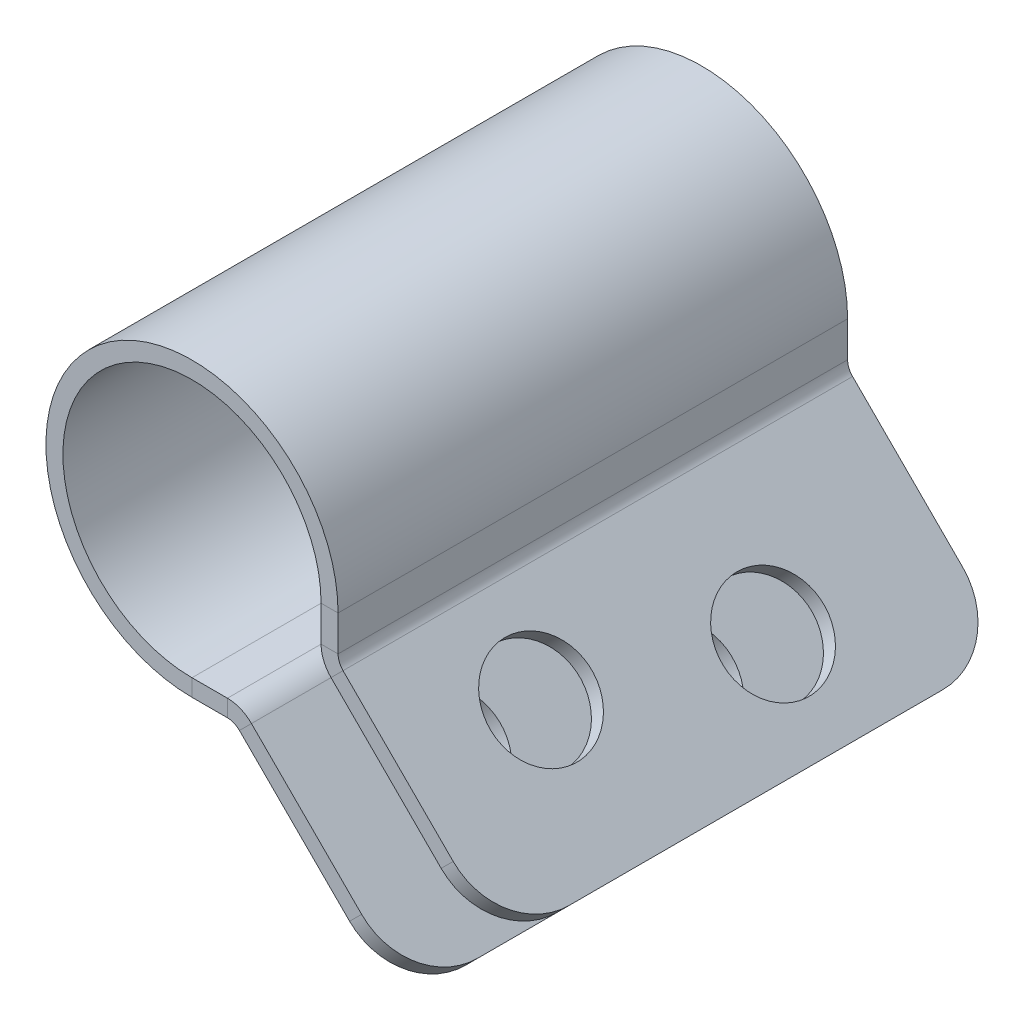
ISO-10303-21;
HEADER;
FILE_DESCRIPTION(('STEP AP214'),'2;1');
FILE_NAME('part.step','',(''),(''),'','','');
FILE_SCHEMA(('AUTOMOTIVE_DESIGN { 1 0 10303 214 1 1 1 1 }'));
ENDSEC;
DATA;
#1=APPLICATION_CONTEXT('core data for automotive mechanical design processes');
#2=APPLICATION_PROTOCOL_DEFINITION('international standard','automotive_design',2000,#1);
#3=PRODUCT_CONTEXT('',#1,'mechanical');
#4=PRODUCT('Part','Part','',(#3));
#5=PRODUCT_RELATED_PRODUCT_CATEGORY('part','',(#4));
#6=PRODUCT_DEFINITION_FORMATION('','',#4);
#7=PRODUCT_DEFINITION_CONTEXT('part definition',#1,'design');
#8=PRODUCT_DEFINITION('design','',#6,#7);
#9=PRODUCT_DEFINITION_SHAPE('','',#8);
#10=(LENGTH_UNIT() NAMED_UNIT(*) SI_UNIT(.MILLI.,.METRE.));
#11=(NAMED_UNIT(*) PLANE_ANGLE_UNIT() SI_UNIT($,.RADIAN.));
#12=(NAMED_UNIT(*) SI_UNIT($,.STERADIAN.) SOLID_ANGLE_UNIT());
#13=UNCERTAINTY_MEASURE_WITH_UNIT(LENGTH_MEASURE(1.E-05),#10,'distance_accuracy_value','');
#14=(GEOMETRIC_REPRESENTATION_CONTEXT(3) GLOBAL_UNCERTAINTY_ASSIGNED_CONTEXT((#13)) GLOBAL_UNIT_ASSIGNED_CONTEXT((#10,
#11,#12)) REPRESENTATION_CONTEXT('',''));
#15=CARTESIAN_POINT('',(0.,0.,0.));
#16=DIRECTION('',(0.,0.,1.));
#17=DIRECTION('',(1.,0.,0.));
#18=AXIS2_PLACEMENT_3D('',#15,#16,#17);
#19=CARTESIAN_POINT('',(3.84258768527902,2.34258768527897,-7.5));
#20=DIRECTION('',(0.,0.,-1.));
#21=DIRECTION('',(0.,-1.,0.));
#22=AXIS2_PLACEMENT_3D('',#19,#20,#21);
#23=PLANE('',#22);
#24=DIRECTION('',(0.,1.,0.));
#25=VECTOR('',#24,1.);
#26=CARTESIAN_POINT('',(4.34258768527924,23.342587685279,-7.5));
#27=LINE('',#26,#25);
#28=CARTESIAN_POINT('',(4.34258768527904,4.29999999999995,-7.5));
#29=VERTEX_POINT('',#28);
#30=CARTESIAN_POINT('',(4.34258768527903,3.25680124765206,-7.5));
#31=VERTEX_POINT('',#30);
#32=EDGE_CURVE('E344',#29,#31,#27,.F.);
#33=ORIENTED_EDGE('',*,*,#32,.T.);
#34=DIRECTION('',(-1.,0.,0.));
#35=VECTOR('',#34,1.);
#36=CARTESIAN_POINT('',(4.34258768527903,3.25680124765206,-7.5));
#37=LINE('',#36,#35);
#38=CARTESIAN_POINT('',(3.84258768527903,3.25680124765206,-7.5));
#39=VERTEX_POINT('',#38);
#40=EDGE_CURVE('E269',#31,#39,#37,.T.);
#41=ORIENTED_EDGE('',*,*,#40,.T.);
#42=DIRECTION('',(0.,-1.,0.));
#43=VECTOR('',#42,1.);
#44=CARTESIAN_POINT('',(3.84258768527902,2.34258768527897,-7.5));
#45=LINE('',#44,#43);
#46=CARTESIAN_POINT('',(3.84258768527904,4.29999999999996,-7.5));
#47=VERTEX_POINT('',#46);
#48=EDGE_CURVE('E381',#47,#39,#45,.T.);
#49=ORIENTED_EDGE('',*,*,#48,.F.);
#50=DIRECTION('',(1.,0.,0.));
#51=VECTOR('',#50,1.);
#52=CARTESIAN_POINT('',(3.84258768527904,4.29999999999996,-7.5));
#53=LINE('',#52,#51);
#54=EDGE_CURVE('E373',#47,#29,#53,.T.);
#55=ORIENTED_EDGE('',*,*,#54,.T.);
#56=EDGE_LOOP('',(#33,#41,#49,#55));
#57=FACE_BOUND('',#56,.T.);
#58=ADVANCED_FACE('F83',(#57),#23,.T.);
#59=CARTESIAN_POINT('',(3.84258768527924,23.342587685279,0.));
#60=DIRECTION('',(-1.,0.,0.));
#61=DIRECTION('',(0.,0.,1.));
#62=AXIS2_PLACEMENT_3D('',#59,#60,#61);
#63=PLANE('',#62);
#64=ORIENTED_EDGE('',*,*,#48,.T.);
#65=DIRECTION('',(0.,0.,-1.));
#66=VECTOR('',#65,1.);
#67=CARTESIAN_POINT('',(3.84258768527903,3.25680124765206,-7.5));
#68=LINE('',#67,#66);
#69=CARTESIAN_POINT('',(3.84258768527903,3.25680124765207,7.5));
#70=VERTEX_POINT('',#69);
#71=EDGE_CURVE('E230',#39,#70,#68,.F.);
#72=ORIENTED_EDGE('',*,*,#71,.T.);
#73=DIRECTION('',(0.,1.,0.));
#74=VECTOR('',#73,1.);
#75=CARTESIAN_POINT('',(3.84258768527902,2.34258768527898,7.5));
#76=LINE('',#75,#74);
#77=CARTESIAN_POINT('',(3.84258768527904,4.29999999999996,7.5));
#78=VERTEX_POINT('',#77);
#79=EDGE_CURVE('E368',#70,#78,#76,.T.);
#80=ORIENTED_EDGE('',*,*,#79,.T.);
#81=DIRECTION('',(0.,0.,-1.));
#82=VECTOR('',#81,1.);
#83=CARTESIAN_POINT('',(3.84258768527904,4.29999999999996,0.));
#84=LINE('',#83,#82);
#85=EDGE_CURVE('E364',#78,#47,#84,.T.);
#86=ORIENTED_EDGE('',*,*,#85,.T.);
#87=EDGE_LOOP('',(#64,#72,#80,#86));
#88=FACE_BOUND('',#87,.T.);
#89=ADVANCED_FACE('F478',(#88),#63,.T.);
#90=CARTESIAN_POINT('',(4.34258768527924,23.342587685279,0.));
#91=DIRECTION('',(-1.,0.,0.));
#92=DIRECTION('',(0.,0.,1.));
#93=AXIS2_PLACEMENT_3D('',#90,#91,#92);
#94=PLANE('',#93);
#95=DIRECTION('',(0.,0.,-1.));
#96=VECTOR('',#95,1.);
#97=CARTESIAN_POINT('',(4.34258768527903,3.25680124765206,-7.5));
#98=LINE('',#97,#96);
#99=CARTESIAN_POINT('',(4.34258768527903,3.25680124765207,7.5));
#100=VERTEX_POINT('',#99);
#101=EDGE_CURVE('E273',#31,#100,#98,.F.);
#102=ORIENTED_EDGE('',*,*,#101,.F.);
#103=ORIENTED_EDGE('',*,*,#32,.F.);
#104=DIRECTION('',(0.,0.,-1.));
#105=VECTOR('',#104,1.);
#106=CARTESIAN_POINT('',(4.34258768527904,4.29999999999995,0.));
#107=LINE('',#106,#105);
#108=CARTESIAN_POINT('',(4.34258768527904,4.29999999999995,7.5));
#109=VERTEX_POINT('',#108);
#110=EDGE_CURVE('E371',#109,#29,#107,.T.);
#111=ORIENTED_EDGE('',*,*,#110,.F.);
#112=DIRECTION('',(0.,1.,0.));
#113=VECTOR('',#112,1.);
#114=CARTESIAN_POINT('',(4.34258768527924,23.342587685279,7.5));
#115=LINE('',#114,#113);
#116=EDGE_CURVE('E379',#100,#109,#115,.T.);
#117=ORIENTED_EDGE('',*,*,#116,.F.);
#118=EDGE_LOOP('',(#102,#103,#111,#117));
#119=FACE_BOUND('',#118,.T.);
#120=ADVANCED_FACE('F484',(#119),#94,.F.);
#121=CARTESIAN_POINT('',(0.,0.5,0.));
#122=DIRECTION('',(0.,1.,0.));
#123=DIRECTION('',(0.,0.,1.));
#124=AXIS2_PLACEMENT_3D('',#121,#122,#123);
#125=PLANE('',#124);
#126=DIRECTION('',(1.,0.,0.));
#127=VECTOR('',#126,1.);
#128=CARTESIAN_POINT('',(-21.,0.5,7.5));
#129=LINE('',#128,#127);
#130=CARTESIAN_POINT('',(0.0425876852790386,0.5,7.5));
#131=VERTEX_POINT('',#130);
#132=CARTESIAN_POINT('',(1.08578643762693,0.499999999999999,7.5));
#133=VERTEX_POINT('',#132);
#134=EDGE_CURVE('E353',#131,#133,#129,.T.);
#135=ORIENTED_EDGE('',*,*,#134,.T.);
#136=DIRECTION('',(0.,0.,1.));
#137=VECTOR('',#136,1.);
#138=CARTESIAN_POINT('',(1.08578643762693,0.499999999999999,7.5));
#139=LINE('',#138,#137);
#140=CARTESIAN_POINT('',(1.08578643762692,0.5,-7.5));
#141=VERTEX_POINT('',#140);
#142=EDGE_CURVE('E308',#133,#141,#139,.F.);
#143=ORIENTED_EDGE('',*,*,#142,.T.);
#144=DIRECTION('',(-1.,0.,0.));
#145=VECTOR('',#144,1.);
#146=CARTESIAN_POINT('',(-21.,0.5,-7.5));
#147=LINE('',#146,#145);
#148=CARTESIAN_POINT('',(0.0425876852790386,0.5,-7.5));
#149=VERTEX_POINT('',#148);
#150=EDGE_CURVE('E351',#141,#149,#147,.T.);
#151=ORIENTED_EDGE('',*,*,#150,.T.);
#152=DIRECTION('',(0.,0.,-1.));
#153=VECTOR('',#152,1.);
#154=CARTESIAN_POINT('',(0.0425876852790377,0.5,0.));
#155=LINE('',#154,#153);
#156=EDGE_CURVE('E337',#131,#149,#155,.T.);
#157=ORIENTED_EDGE('',*,*,#156,.F.);
#158=EDGE_LOOP('',(#135,#143,#151,#157));
#159=FACE_BOUND('',#158,.T.);
#160=ADVANCED_FACE('F455',(#159),#125,.T.);
#161=CARTESIAN_POINT('',(-21.,0.5,7.5));
#162=DIRECTION('',(0.,0.,1.));
#163=DIRECTION('',(1.,0.,0.));
#164=AXIS2_PLACEMENT_3D('',#161,#162,#163);
#165=PLANE('',#164);
#166=DIRECTION('',(1.,0.,0.));
#167=VECTOR('',#166,1.);
#168=CARTESIAN_POINT('',(0.,0.,7.5));
#169=LINE('',#168,#167);
#170=CARTESIAN_POINT('',(0.0425876852790377,0.,7.5));
#171=VERTEX_POINT('',#170);
#172=CARTESIAN_POINT('',(1.08578643762693,0.,7.5));
#173=VERTEX_POINT('',#172);
#174=EDGE_CURVE('E348',#171,#173,#169,.T.);
#175=ORIENTED_EDGE('',*,*,#174,.T.);
#176=DIRECTION('',(0.,1.,0.));
#177=VECTOR('',#176,1.);
#178=CARTESIAN_POINT('',(1.08578643762693,0.,7.5));
#179=LINE('',#178,#177);
#180=EDGE_CURVE('E315',#173,#133,#179,.T.);
#181=ORIENTED_EDGE('',*,*,#180,.T.);
#182=ORIENTED_EDGE('',*,*,#134,.F.);
#183=DIRECTION('',(0.,1.,0.));
#184=VECTOR('',#183,1.);
#185=CARTESIAN_POINT('',(0.0425876852790386,0.5,7.5));
#186=LINE('',#185,#184);
#187=EDGE_CURVE('E356',#171,#131,#186,.T.);
#188=ORIENTED_EDGE('',*,*,#187,.F.);
#189=EDGE_LOOP('',(#175,#181,#182,#188));
#190=FACE_BOUND('',#189,.T.);
#191=ADVANCED_FACE('F460',(#190),#165,.T.);
#192=CARTESIAN_POINT('',(0.,0.,0.));
#193=DIRECTION('',(0.,1.,0.));
#194=DIRECTION('',(0.,0.,1.));
#195=AXIS2_PLACEMENT_3D('',#192,#193,#194);
#196=PLANE('',#195);
#197=DIRECTION('',(0.,0.,1.));
#198=VECTOR('',#197,1.);
#199=CARTESIAN_POINT('',(1.08578643762693,0.,7.5));
#200=LINE('',#199,#198);
#201=CARTESIAN_POINT('',(1.08578643762692,0.,-7.5));
#202=VERTEX_POINT('',#201);
#203=EDGE_CURVE('E321',#173,#202,#200,.F.);
#204=ORIENTED_EDGE('',*,*,#203,.F.);
#205=ORIENTED_EDGE('',*,*,#174,.F.);
#206=DIRECTION('',(0.,0.,-1.));
#207=VECTOR('',#206,1.);
#208=CARTESIAN_POINT('',(0.0425876852790377,0.,0.));
#209=LINE('',#208,#207);
#210=CARTESIAN_POINT('',(0.0425876852790377,0.,-7.5));
#211=VERTEX_POINT('',#210);
#212=EDGE_CURVE('E345',#171,#211,#209,.T.);
#213=ORIENTED_EDGE('',*,*,#212,.T.);
#214=DIRECTION('',(1.,0.,0.));
#215=VECTOR('',#214,1.);
#216=CARTESIAN_POINT('',(0.,0.,-7.5));
#217=LINE('',#216,#215);
#218=EDGE_CURVE('E342',#202,#211,#217,.F.);
#219=ORIENTED_EDGE('',*,*,#218,.F.);
#220=EDGE_LOOP('',(#204,#205,#213,#219));
#221=FACE_BOUND('',#220,.T.);
#222=ADVANCED_FACE('F465',(#221),#196,.F.);
#223=CARTESIAN_POINT('',(3.84258768527902,2.34258768527898,7.5));
#224=DIRECTION('',(0.,0.,1.));
#225=DIRECTION('',(0.,1.,0.));
#226=AXIS2_PLACEMENT_3D('',#223,#224,#225);
#227=PLANE('',#226);
#228=DIRECTION('',(-1.,0.,0.));
#229=VECTOR('',#228,1.);
#230=CARTESIAN_POINT('',(4.34258768527903,3.25680124765207,7.5));
#231=LINE('',#230,#229);
#232=EDGE_CURVE('E276',#100,#70,#231,.T.);
#233=ORIENTED_EDGE('',*,*,#232,.F.);
#234=ORIENTED_EDGE('',*,*,#116,.T.);
#235=DIRECTION('',(-1.,0.,0.));
#236=VECTOR('',#235,1.);
#237=CARTESIAN_POINT('',(3.84258768527904,4.29999999999996,7.5));
#238=LINE('',#237,#236);
#239=EDGE_CURVE('E367',#109,#78,#238,.T.);
#240=ORIENTED_EDGE('',*,*,#239,.T.);
#241=ORIENTED_EDGE('',*,*,#79,.F.);
#242=EDGE_LOOP('',(#233,#234,#240,#241));
#243=FACE_BOUND('',#242,.T.);
#244=ADVANCED_FACE('F532',(#243),#227,.T.);
#245=CARTESIAN_POINT('',(-21.,0.5,-7.5));
#246=DIRECTION('',(0.,0.,-1.));
#247=DIRECTION('',(-1.,0.,0.));
#248=AXIS2_PLACEMENT_3D('',#245,#246,#247);
#249=PLANE('',#248);
#250=DIRECTION('',(0.,1.,0.));
#251=VECTOR('',#250,1.);
#252=CARTESIAN_POINT('',(1.08578643762692,0.,-7.5));
#253=LINE('',#252,#251);
#254=EDGE_CURVE('E325',#202,#141,#253,.T.);
#255=ORIENTED_EDGE('',*,*,#254,.F.);
#256=ORIENTED_EDGE('',*,*,#218,.T.);
#257=DIRECTION('',(0.,-1.,0.));
#258=VECTOR('',#257,1.);
#259=CARTESIAN_POINT('',(0.0425876852790351,0.5,-7.5));
#260=LINE('',#259,#258);
#261=EDGE_CURVE('E359',#149,#211,#260,.T.);
#262=ORIENTED_EDGE('',*,*,#261,.F.);
#263=ORIENTED_EDGE('',*,*,#150,.F.);
#264=EDGE_LOOP('',(#255,#256,#262,#263));
#265=FACE_BOUND('',#264,.T.);
#266=ADVANCED_FACE('F452',(#265),#249,.T.);
#267=CARTESIAN_POINT('',(0.0425876852790386,4.3,7.5));
#268=DIRECTION('',(0.,0.,-1.));
#269=DIRECTION('',(0.,1.,0.));
#270=AXIS2_PLACEMENT_3D('',#267,#268,#269);
#271=PLANE('',#270);
#272=ORIENTED_EDGE('',*,*,#239,.F.);
#273=CARTESIAN_POINT('',(0.0425876852790386,4.3,7.5));
#274=DIRECTION('',(0.,0.,1.));
#275=DIRECTION('',(1.,0.,0.));
#276=AXIS2_PLACEMENT_3D('',#273,#274,#275);
#277=CIRCLE('',#276,4.3);
#278=EDGE_CURVE('E328',#109,#171,#277,.T.);
#279=ORIENTED_EDGE('',*,*,#278,.T.);
#280=ORIENTED_EDGE('',*,*,#187,.T.);
#281=CARTESIAN_POINT('',(0.0425876852790386,4.3,7.5));
#282=DIRECTION('',(0.,0.,1.));
#283=DIRECTION('',(0.,-1.,0.));
#284=AXIS2_PLACEMENT_3D('',#281,#282,#283);
#285=CIRCLE('',#284,3.8);
#286=EDGE_CURVE('E331',#78,#131,#285,.T.);
#287=ORIENTED_EDGE('',*,*,#286,.F.);
#288=EDGE_LOOP('',(#272,#279,#280,#287));
#289=FACE_BOUND('',#288,.T.);
#290=ADVANCED_FACE('F541',(#289),#271,.F.);
#291=CARTESIAN_POINT('',(0.0425876852790368,4.3,-7.5));
#292=DIRECTION('',(0.,0.,1.));
#293=DIRECTION('',(1.,0.,0.));
#294=AXIS2_PLACEMENT_3D('',#291,#292,#293);
#295=PLANE('',#294);
#296=CARTESIAN_POINT('',(0.0425876852790368,4.3,-7.5));
#297=DIRECTION('',(0.,0.,1.));
#298=DIRECTION('',(1.,0.,0.));
#299=AXIS2_PLACEMENT_3D('',#296,#297,#298);
#300=CIRCLE('',#299,4.3);
#301=EDGE_CURVE('E335',#211,#29,#300,.F.);
#302=ORIENTED_EDGE('',*,*,#301,.T.);
#303=ORIENTED_EDGE('',*,*,#54,.F.);
#304=CARTESIAN_POINT('',(0.0425876852790368,4.3,-7.5));
#305=DIRECTION('',(0.,0.,-1.));
#306=DIRECTION('',(-1.,0.,0.));
#307=AXIS2_PLACEMENT_3D('',#304,#305,#306);
#308=CIRCLE('',#307,3.8);
#309=EDGE_CURVE('E334',#149,#47,#308,.T.);
#310=ORIENTED_EDGE('',*,*,#309,.F.);
#311=ORIENTED_EDGE('',*,*,#261,.T.);
#312=EDGE_LOOP('',(#302,#303,#310,#311));
#313=FACE_BOUND('',#312,.T.);
#314=ADVANCED_FACE('F547',(#313),#295,.F.);
#315=CARTESIAN_POINT('',(0.0425876852790349,4.3,-24.2794958540114));
#316=DIRECTION('',(0.,0.,1.));
#317=DIRECTION('',(1.,0.,0.));
#318=AXIS2_PLACEMENT_3D('',#315,#316,#317);
#319=CYLINDRICAL_SURFACE('',#318,3.8);
#320=ORIENTED_EDGE('',*,*,#156,.T.);
#321=ORIENTED_EDGE('',*,*,#309,.T.);
#322=ORIENTED_EDGE('',*,*,#85,.F.);
#323=ORIENTED_EDGE('',*,*,#286,.T.);
#324=EDGE_LOOP('',(#320,#321,#322,#323));
#325=FACE_BOUND('',#324,.T.);
#326=ADVANCED_FACE('F537',(#325),#319,.F.);
#327=CARTESIAN_POINT('',(0.0425876852790349,4.3,-24.2794958540114));
#328=DIRECTION('',(0.,0.,1.));
#329=DIRECTION('',(1.,0.,0.));
#330=AXIS2_PLACEMENT_3D('',#327,#328,#329);
#331=CYLINDRICAL_SURFACE('',#330,4.3);
#332=ORIENTED_EDGE('',*,*,#212,.F.);
#333=ORIENTED_EDGE('',*,*,#278,.F.);
#334=ORIENTED_EDGE('',*,*,#110,.T.);
#335=ORIENTED_EDGE('',*,*,#301,.F.);
#336=EDGE_LOOP('',(#332,#333,#334,#335));
#337=FACE_BOUND('',#336,.T.);
#338=ADVANCED_FACE('F544',(#337),#331,.T.);
#339=CARTESIAN_POINT('',(1.08578643762692,-0.500000000000001,-7.5));
#340=DIRECTION('',(0.,0.,-1.));
#341=DIRECTION('',(-1.,0.,0.));
#342=AXIS2_PLACEMENT_3D('',#339,#340,#341);
#343=PLANE('',#342);
#344=DIRECTION('',(-0.707106781186544,-0.707106781186551,0.));
#345=VECTOR('',#344,1.);
#346=CARTESIAN_POINT('',(1.79289321881347,0.207106781186551,-7.5));
#347=LINE('',#346,#345);
#348=CARTESIAN_POINT('',(1.43933982822019,-0.146446609406725,-7.5));
#349=VERTEX_POINT('',#348);
#350=CARTESIAN_POINT('',(1.79289321881347,0.207106781186551,-7.5));
#351=VERTEX_POINT('',#350);
#352=EDGE_CURVE('E279',#349,#351,#347,.F.);
#353=ORIENTED_EDGE('',*,*,#352,.F.);
#354=CARTESIAN_POINT('',(1.08578643762692,-0.500000000000001,-7.5));
#355=DIRECTION('',(0.,0.,1.));
#356=DIRECTION('',(1.,0.,0.));
#357=AXIS2_PLACEMENT_3D('',#354,#355,#356);
#358=CIRCLE('',#357,0.5);
#359=EDGE_CURVE('E318',#202,#349,#358,.F.);
#360=ORIENTED_EDGE('',*,*,#359,.F.);
#361=ORIENTED_EDGE('',*,*,#254,.T.);
#362=CARTESIAN_POINT('',(1.08578643762692,-0.500000000000001,-7.5));
#363=DIRECTION('',(0.,0.,1.));
#364=DIRECTION('',(1.,0.,0.));
#365=AXIS2_PLACEMENT_3D('',#362,#363,#364);
#366=CIRCLE('',#365,1.);
#367=EDGE_CURVE('E311',#141,#351,#366,.F.);
#368=ORIENTED_EDGE('',*,*,#367,.T.);
#369=EDGE_LOOP('',(#353,#360,#361,#368));
#370=FACE_BOUND('',#369,.T.);
#371=ADVANCED_FACE('F445',(#370),#343,.T.);
#372=CARTESIAN_POINT('',(1.08578643762693,-0.500000000000001,7.5));
#373=DIRECTION('',(0.,0.,-1.));
#374=DIRECTION('',(-1.,0.,0.));
#375=AXIS2_PLACEMENT_3D('',#372,#373,#374);
#376=PLANE('',#375);
#377=CARTESIAN_POINT('',(1.08578643762693,-0.500000000000001,7.5));
#378=DIRECTION('',(0.,0.,1.));
#379=DIRECTION('',(1.,0.,0.));
#380=AXIS2_PLACEMENT_3D('',#377,#378,#379);
#381=CIRCLE('',#380,0.5);
#382=CARTESIAN_POINT('',(1.4393398282202,-0.146446609406725,7.5));
#383=VERTEX_POINT('',#382);
#384=EDGE_CURVE('E283',#383,#173,#381,.T.);
#385=ORIENTED_EDGE('',*,*,#384,.F.);
#386=DIRECTION('',(-0.707106781186544,-0.707106781186551,0.));
#387=VECTOR('',#386,1.);
#388=CARTESIAN_POINT('',(1.4393398282202,-0.146446609406724,7.5));
#389=LINE('',#388,#387);
#390=CARTESIAN_POINT('',(1.79289321881347,0.207106781186551,7.5));
#391=VERTEX_POINT('',#390);
#392=EDGE_CURVE('E301',#383,#391,#389,.F.);
#393=ORIENTED_EDGE('',*,*,#392,.T.);
#394=CARTESIAN_POINT('',(1.08578643762693,-0.500000000000001,7.5));
#395=DIRECTION('',(0.,0.,1.));
#396=DIRECTION('',(1.,0.,0.));
#397=AXIS2_PLACEMENT_3D('',#394,#395,#396);
#398=CIRCLE('',#397,1.);
#399=EDGE_CURVE('E312',#391,#133,#398,.T.);
#400=ORIENTED_EDGE('',*,*,#399,.T.);
#401=ORIENTED_EDGE('',*,*,#180,.F.);
#402=EDGE_LOOP('',(#385,#393,#400,#401));
#403=FACE_BOUND('',#402,.T.);
#404=ADVANCED_FACE('F458',(#403),#376,.F.);
#405=CARTESIAN_POINT('',(1.08578643762693,-0.500000000000001,7.5));
#406=DIRECTION('',(0.,0.,1.));
#407=DIRECTION('',(0.707106781186544,0.707106781186551,0.));
#408=AXIS2_PLACEMENT_3D('',#405,#406,#407);
#409=CYLINDRICAL_SURFACE('',#408,1.);
#410=ORIENTED_EDGE('',*,*,#142,.F.);
#411=ORIENTED_EDGE('',*,*,#399,.F.);
#412=DIRECTION('',(0.,0.,1.));
#413=VECTOR('',#412,1.);
#414=CARTESIAN_POINT('',(1.79289321881347,0.207106781186551,-7.5));
#415=LINE('',#414,#413);
#416=EDGE_CURVE('E298',#391,#351,#415,.F.);
#417=ORIENTED_EDGE('',*,*,#416,.T.);
#418=ORIENTED_EDGE('',*,*,#367,.F.);
#419=EDGE_LOOP('',(#410,#411,#417,#418));
#420=FACE_BOUND('',#419,.T.);
#421=ADVANCED_FACE('F443',(#420),#409,.T.);
#422=CARTESIAN_POINT('',(1.08578643762693,-0.500000000000001,7.5));
#423=DIRECTION('',(0.,0.,1.));
#424=DIRECTION('',(0.707106781186544,0.707106781186551,0.));
#425=AXIS2_PLACEMENT_3D('',#422,#423,#424);
#426=CYLINDRICAL_SURFACE('',#425,0.5);
#427=ORIENTED_EDGE('',*,*,#203,.T.);
#428=ORIENTED_EDGE('',*,*,#359,.T.);
#429=DIRECTION('',(0.,0.,1.));
#430=VECTOR('',#429,1.);
#431=CARTESIAN_POINT('',(1.43933982822019,-0.146446609406725,-7.5));
#432=LINE('',#431,#430);
#433=EDGE_CURVE('E304',#349,#383,#432,.T.);
#434=ORIENTED_EDGE('',*,*,#433,.T.);
#435=ORIENTED_EDGE('',*,*,#384,.T.);
#436=EDGE_LOOP('',(#427,#428,#434,#435));
#437=FACE_BOUND('',#436,.T.);
#438=ADVANCED_FACE('F467',(#437),#426,.F.);
#439=CARTESIAN_POINT('',(6.44974746830588,-4.44974746830581,7.5));
#440=DIRECTION('',(0.,0.,-1.));
#441=DIRECTION('',(0.,1.,0.));
#442=AXIS2_PLACEMENT_3D('',#439,#440,#441);
#443=PLANE('',#442);
#444=DIRECTION('',(-0.707106781186551,0.707106781186544,0.));
#445=VECTOR('',#444,1.);
#446=CARTESIAN_POINT('',(6.0961940777126,-4.80330085889908,7.5));
#447=LINE('',#446,#445);
#448=CARTESIAN_POINT('',(4.6819805153395,-3.38908729652599,7.5));
#449=VERTEX_POINT('',#448);
#450=EDGE_CURVE('E295',#383,#449,#447,.F.);
#451=ORIENTED_EDGE('',*,*,#450,.T.);
#452=DIRECTION('',(-0.707106781186544,-0.707106781186551,0.));
#453=VECTOR('',#452,1.);
#454=CARTESIAN_POINT('',(5.03553390593277,-3.03553390593272,7.5));
#455=LINE('',#454,#453);
#456=CARTESIAN_POINT('',(5.03553390593277,-3.03553390593272,7.5));
#457=VERTEX_POINT('',#456);
#458=EDGE_CURVE('E91',#449,#457,#455,.F.);
#459=ORIENTED_EDGE('',*,*,#458,.T.);
#460=DIRECTION('',(0.707106781186551,-0.707106781186544,0.));
#461=VECTOR('',#460,1.);
#462=CARTESIAN_POINT('',(0.646446609406721,1.35355339059329,7.5));
#463=LINE('',#462,#461);
#464=EDGE_CURVE('E287',#391,#457,#463,.T.);
#465=ORIENTED_EDGE('',*,*,#464,.F.);
#466=ORIENTED_EDGE('',*,*,#392,.F.);
#467=EDGE_LOOP('',(#451,#459,#465,#466));
#468=FACE_BOUND('',#467,.T.);
#469=ADVANCED_FACE('F415',(#468),#443,.F.);
#470=CARTESIAN_POINT('',(1.64644660940674,0.353553390593275,-7.5));
#471=DIRECTION('',(0.,0.,1.));
#472=DIRECTION('',(0.,-1.,0.));
#473=AXIS2_PLACEMENT_3D('',#470,#471,#472);
#474=PLANE('',#473);
#475=DIRECTION('',(-0.707106781186551,0.707106781186544,0.));
#476=VECTOR('',#475,1.);
#477=CARTESIAN_POINT('',(0.64644660940672,1.35355339059328,-7.5));
#478=LINE('',#477,#476);
#479=CARTESIAN_POINT('',(5.03553390593277,-3.03553390593272,-7.5));
#480=VERTEX_POINT('',#479);
#481=EDGE_CURVE('E281',#480,#351,#478,.T.);
#482=ORIENTED_EDGE('',*,*,#481,.F.);
#483=DIRECTION('',(-0.707106781186544,-0.707106781186551,0.));
#484=VECTOR('',#483,1.);
#485=CARTESIAN_POINT('',(5.03553390593277,-3.03553390593272,-7.5));
#486=LINE('',#485,#484);
#487=CARTESIAN_POINT('',(4.6819805153395,-3.38908729652599,-7.5));
#488=VERTEX_POINT('',#487);
#489=EDGE_CURVE('E376',#480,#488,#486,.T.);
#490=ORIENTED_EDGE('',*,*,#489,.T.);
#491=DIRECTION('',(0.707106781186551,-0.707106781186544,0.));
#492=VECTOR('',#491,1.);
#493=CARTESIAN_POINT('',(1.29289321881347,0.,-7.5));
#494=LINE('',#493,#492);
#495=EDGE_CURVE('E290',#488,#349,#494,.F.);
#496=ORIENTED_EDGE('',*,*,#495,.T.);
#497=ORIENTED_EDGE('',*,*,#352,.T.);
#498=EDGE_LOOP('',(#482,#490,#496,#497));
#499=FACE_BOUND('',#498,.T.);
#500=ADVANCED_FACE('F440',(#499),#474,.F.);
#501=CARTESIAN_POINT('',(0.64644660940672,1.35355339059329,0.));
#502=DIRECTION('',(-0.707106781186544,-0.707106781186551,0.));
#503=DIRECTION('',(0.707106781186551,-0.707106781186544,0.));
#504=AXIS2_PLACEMENT_3D('',#501,#502,#503);
#505=PLANE('',#504);
#506=CARTESIAN_POINT('',(3.62132034355965,-1.62132034355961,3.5));
#507=DIRECTION('',(-0.707106781186544,-0.707106781186551,0.));
#508=DIRECTION('',(0.707106781186551,-0.707106781186544,0.));
#509=AXIS2_PLACEMENT_3D('',#506,#507,#508);
#510=CIRCLE('',#509,1.5);
#511=CARTESIAN_POINT('',(4.68198051533948,-2.68198051533943,3.5));
#512=VERTEX_POINT('',#511);
#513=EDGE_CURVE('E900',#512,#512,#510,.T.);
#514=ORIENTED_EDGE('',*,*,#513,.T.);
#515=EDGE_LOOP('',(#514));
#516=FACE_BOUND('',#515,.T.);
#517=CARTESIAN_POINT('',(4.49106168441911,-2.49106168441906,-2.46));
#518=DIRECTION('',(-0.707106781186544,-0.707106781186551,0.));
#519=DIRECTION('',(0.707106781186551,-0.707106781186544,0.));
#520=AXIS2_PLACEMENT_3D('',#517,#518,#519);
#521=CIRCLE('',#520,1.5);
#522=CARTESIAN_POINT('',(5.55172185619893,-3.55172185619888,-2.46));
#523=VERTEX_POINT('',#522);
#524=EDGE_CURVE('E266',#523,#523,#521,.T.);
#525=ORIENTED_EDGE('',*,*,#524,.T.);
#526=EDGE_LOOP('',(#525));
#527=FACE_BOUND('',#526,.T.);
#528=DIRECTION('',(0.,0.,-1.));
#529=VECTOR('',#528,1.);
#530=CARTESIAN_POINT('',(6.44974746830587,-4.44974746830581,0.));
#531=LINE('',#530,#529);
#532=CARTESIAN_POINT('',(6.44974746830587,-4.44974746830581,5.5));
#533=VERTEX_POINT('',#532);
#534=CARTESIAN_POINT('',(6.44974746830587,-4.44974746830581,-5.5));
#535=VERTEX_POINT('',#534);
#536=EDGE_CURVE('E284',#533,#535,#531,.T.);
#537=ORIENTED_EDGE('',*,*,#536,.T.);
#538=CARTESIAN_POINT('',(5.03553390593277,-3.03553390593272,-5.5));
#539=DIRECTION('',(-0.707106781186544,-0.707106781186551,0.));
#540=DIRECTION('',(0.707106781186551,-0.707106781186544,0.));
#541=AXIS2_PLACEMENT_3D('',#538,#539,#540);
#542=CIRCLE('',#541,2.);
#543=EDGE_CURVE('E398',#535,#480,#542,.F.);
#544=ORIENTED_EDGE('',*,*,#543,.T.);
#545=ORIENTED_EDGE('',*,*,#481,.T.);
#546=ORIENTED_EDGE('',*,*,#416,.F.);
#547=ORIENTED_EDGE('',*,*,#464,.T.);
#548=CARTESIAN_POINT('',(5.03553390593277,-3.03553390593272,5.5));
#549=DIRECTION('',(-0.707106781186544,-0.707106781186551,0.));
#550=DIRECTION('',(0.707106781186551,-0.707106781186544,0.));
#551=AXIS2_PLACEMENT_3D('',#548,#549,#550);
#552=CIRCLE('',#551,2.);
#553=EDGE_CURVE('E396',#457,#533,#552,.F.);
#554=ORIENTED_EDGE('',*,*,#553,.T.);
#555=EDGE_LOOP('',(#537,#544,#545,#546,#547,#554));
#556=FACE_BOUND('',#555,.T.);
#557=ADVANCED_FACE('F422',(#516,#527,#556),#505,.F.);
#558=CARTESIAN_POINT('',(0.292893218813448,1.00000000000001,0.));
#559=DIRECTION('',(-0.707106781186544,-0.707106781186551,0.));
#560=DIRECTION('',(0.707106781186551,-0.707106781186544,0.));
#561=AXIS2_PLACEMENT_3D('',#558,#559,#560);
#562=PLANE('',#561);
#563=CARTESIAN_POINT('',(3.26776695296637,-1.97487373415288,3.5));
#564=DIRECTION('',(-0.707106781186544,-0.707106781186551,0.));
#565=DIRECTION('',(0.707106781186551,-0.707106781186544,0.));
#566=AXIS2_PLACEMENT_3D('',#563,#564,#565);
#567=CIRCLE('',#566,1.5);
#568=CARTESIAN_POINT('',(4.3284271247462,-3.0355339059327,3.5));
#569=VERTEX_POINT('',#568);
#570=EDGE_CURVE('E897',#569,#569,#567,.T.);
#571=ORIENTED_EDGE('',*,*,#570,.F.);
#572=EDGE_LOOP('',(#571));
#573=FACE_BOUND('',#572,.T.);
#574=CARTESIAN_POINT('',(4.13750829382583,-2.84461507501233,-2.46));
#575=DIRECTION('',(-0.707106781186544,-0.707106781186551,0.));
#576=DIRECTION('',(0.707106781186551,-0.707106781186544,0.));
#577=AXIS2_PLACEMENT_3D('',#574,#575,#576);
#578=CIRCLE('',#577,1.5);
#579=CARTESIAN_POINT('',(5.19816846560566,-3.90527524679215,-2.46));
#580=VERTEX_POINT('',#579);
#581=EDGE_CURVE('E912',#580,#580,#578,.T.);
#582=ORIENTED_EDGE('',*,*,#581,.F.);
#583=EDGE_LOOP('',(#582));
#584=FACE_BOUND('',#583,.T.);
#585=ORIENTED_EDGE('',*,*,#495,.F.);
#586=CARTESIAN_POINT('',(4.6819805153395,-3.38908729652599,-5.5));
#587=DIRECTION('',(-0.707106781186544,-0.707106781186551,0.));
#588=DIRECTION('',(0.707106781186551,-0.707106781186544,0.));
#589=AXIS2_PLACEMENT_3D('',#586,#587,#588);
#590=CIRCLE('',#589,2.);
#591=CARTESIAN_POINT('',(6.0961940777126,-4.80330085889908,-5.5));
#592=VERTEX_POINT('',#591);
#593=EDGE_CURVE('E389',#488,#592,#590,.T.);
#594=ORIENTED_EDGE('',*,*,#593,.T.);
#595=DIRECTION('',(0.,0.,1.));
#596=VECTOR('',#595,1.);
#597=CARTESIAN_POINT('',(6.0961940777126,-4.80330085889908,-7.5));
#598=LINE('',#597,#596);
#599=CARTESIAN_POINT('',(6.0961940777126,-4.80330085889908,5.5));
#600=VERTEX_POINT('',#599);
#601=EDGE_CURVE('E292',#600,#592,#598,.F.);
#602=ORIENTED_EDGE('',*,*,#601,.F.);
#603=CARTESIAN_POINT('',(4.6819805153395,-3.38908729652599,5.5));
#604=DIRECTION('',(-0.707106781186544,-0.707106781186551,0.));
#605=DIRECTION('',(0.707106781186551,-0.707106781186544,0.));
#606=AXIS2_PLACEMENT_3D('',#603,#604,#605);
#607=CIRCLE('',#606,2.);
#608=EDGE_CURVE('E387',#600,#449,#607,.T.);
#609=ORIENTED_EDGE('',*,*,#608,.T.);
#610=ORIENTED_EDGE('',*,*,#450,.F.);
#611=ORIENTED_EDGE('',*,*,#433,.F.);
#612=EDGE_LOOP('',(#585,#594,#602,#609,#610,#611));
#613=FACE_BOUND('',#612,.T.);
#614=ADVANCED_FACE('F432',(#573,#584,#613),#562,.T.);
#615=CARTESIAN_POINT('',(6.44974746830587,-4.44974746830581,-7.5));
#616=DIRECTION('',(-0.707106781186551,0.707106781186544,0.));
#617=DIRECTION('',(-0.707106781186544,-0.707106781186551,0.));
#618=AXIS2_PLACEMENT_3D('',#615,#616,#617);
#619=PLANE('',#618);
#620=ORIENTED_EDGE('',*,*,#601,.T.);
#621=DIRECTION('',(-0.707106781186544,-0.707106781186551,0.));
#622=VECTOR('',#621,1.);
#623=CARTESIAN_POINT('',(6.44974746830587,-4.44974746830581,-5.5));
#624=LINE('',#623,#622);
#625=EDGE_CURVE('E394',#592,#535,#624,.F.);
#626=ORIENTED_EDGE('',*,*,#625,.T.);
#627=ORIENTED_EDGE('',*,*,#536,.F.);
#628=DIRECTION('',(-0.707106781186544,-0.707106781186551,0.));
#629=VECTOR('',#628,1.);
#630=CARTESIAN_POINT('',(6.44974746830587,-4.44974746830581,5.5));
#631=LINE('',#630,#629);
#632=EDGE_CURVE('E391',#533,#600,#631,.T.);
#633=ORIENTED_EDGE('',*,*,#632,.T.);
#634=EDGE_LOOP('',(#620,#626,#627,#633));
#635=FACE_BOUND('',#634,.T.);
#636=ADVANCED_FACE('F428',(#635),#619,.F.);
#637=CARTESIAN_POINT('',(4.84258768527903,3.25680124765206,7.5));
#638=DIRECTION('',(0.,0.,1.));
#639=DIRECTION('',(0.,-1.,0.));
#640=AXIS2_PLACEMENT_3D('',#637,#638,#639);
#641=PLANE('',#640);
#642=DIRECTION('',(0.707106781186559,0.707106781186536,0.));
#643=VECTOR('',#642,1.);
#644=CARTESIAN_POINT('',(4.13548090409247,2.54969446646552,7.5));
#645=LINE('',#644,#643);
#646=CARTESIAN_POINT('',(4.48903429468575,2.90324785705879,7.5));
#647=VERTEX_POINT('',#646);
#648=CARTESIAN_POINT('',(4.13548090409247,2.54969446646552,7.5));
#649=VERTEX_POINT('',#648);
#650=EDGE_CURVE('E263',#647,#649,#645,.F.);
#651=ORIENTED_EDGE('',*,*,#650,.F.);
#652=CARTESIAN_POINT('',(4.84258768527903,3.25680124765206,7.5));
#653=DIRECTION('',(0.,0.,-1.));
#654=DIRECTION('',(0.,1.,0.));
#655=AXIS2_PLACEMENT_3D('',#652,#653,#654);
#656=CIRCLE('',#655,0.499999999999999);
#657=EDGE_CURVE('E233',#100,#647,#656,.F.);
#658=ORIENTED_EDGE('',*,*,#657,.F.);
#659=ORIENTED_EDGE('',*,*,#232,.T.);
#660=CARTESIAN_POINT('',(4.84258768527903,3.25680124765206,7.5));
#661=DIRECTION('',(0.,0.,-1.));
#662=DIRECTION('',(0.,1.,0.));
#663=AXIS2_PLACEMENT_3D('',#660,#661,#662);
#664=CIRCLE('',#663,1.);
#665=EDGE_CURVE('E268',#70,#649,#664,.F.);
#666=ORIENTED_EDGE('',*,*,#665,.T.);
#667=EDGE_LOOP('',(#651,#658,#659,#666));
#668=FACE_BOUND('',#667,.T.);
#669=ADVANCED_FACE('F524',(#668),#641,.T.);
#670=CARTESIAN_POINT('',(4.84258768527903,3.25680124765205,-7.5));
#671=DIRECTION('',(0.,0.,1.));
#672=DIRECTION('',(0.,-1.,0.));
#673=AXIS2_PLACEMENT_3D('',#670,#671,#672);
#674=PLANE('',#673);
#675=CARTESIAN_POINT('',(4.84258768527903,3.25680124765205,-7.5));
#676=DIRECTION('',(0.,0.,-1.));
#677=DIRECTION('',(0.,1.,0.));
#678=AXIS2_PLACEMENT_3D('',#675,#676,#677);
#679=CIRCLE('',#678,0.499999999999999);
#680=CARTESIAN_POINT('',(4.48903429468575,2.90324785705879,-7.5));
#681=VERTEX_POINT('',#680);
#682=EDGE_CURVE('E240',#681,#31,#679,.T.);
#683=ORIENTED_EDGE('',*,*,#682,.F.);
#684=DIRECTION('',(0.707106781186559,0.707106781186536,0.));
#685=VECTOR('',#684,1.);
#686=CARTESIAN_POINT('',(4.48903429468575,2.90324785705878,-7.5));
#687=LINE('',#686,#685);
#688=CARTESIAN_POINT('',(4.13548090409247,2.54969446646552,-7.5));
#689=VERTEX_POINT('',#688);
#690=EDGE_CURVE('E237',#681,#689,#687,.F.);
#691=ORIENTED_EDGE('',*,*,#690,.T.);
#692=CARTESIAN_POINT('',(4.84258768527903,3.25680124765205,-7.5));
#693=DIRECTION('',(0.,0.,-1.));
#694=DIRECTION('',(0.,1.,0.));
#695=AXIS2_PLACEMENT_3D('',#692,#693,#694);
#696=CIRCLE('',#695,1.);
#697=EDGE_CURVE('E223',#689,#39,#696,.T.);
#698=ORIENTED_EDGE('',*,*,#697,.T.);
#699=ORIENTED_EDGE('',*,*,#40,.F.);
#700=EDGE_LOOP('',(#683,#691,#698,#699));
#701=FACE_BOUND('',#700,.T.);
#702=ADVANCED_FACE('F238',(#701),#674,.F.);
#703=CARTESIAN_POINT('',(4.84258768527903,3.25680124765205,-7.5));
#704=DIRECTION('',(0.,0.,-1.));
#705=DIRECTION('',(-0.707106781186559,-0.707106781186536,0.));
#706=AXIS2_PLACEMENT_3D('',#703,#704,#705);
#707=CYLINDRICAL_SURFACE('',#706,1.);
#708=ORIENTED_EDGE('',*,*,#71,.F.);
#709=ORIENTED_EDGE('',*,*,#697,.F.);
#710=DIRECTION('',(0.,0.,-1.));
#711=VECTOR('',#710,1.);
#712=CARTESIAN_POINT('',(4.13548090409247,2.54969446646552,7.5));
#713=LINE('',#712,#711);
#714=EDGE_CURVE('E227',#689,#649,#713,.F.);
#715=ORIENTED_EDGE('',*,*,#714,.T.);
#716=ORIENTED_EDGE('',*,*,#665,.F.);
#717=EDGE_LOOP('',(#708,#709,#715,#716));
#718=FACE_BOUND('',#717,.T.);
#719=ADVANCED_FACE('F225',(#718),#707,.T.);
#720=CARTESIAN_POINT('',(4.84258768527903,3.25680124765205,-7.5));
#721=DIRECTION('',(0.,0.,-1.));
#722=DIRECTION('',(-0.707106781186559,-0.707106781186536,0.));
#723=AXIS2_PLACEMENT_3D('',#720,#721,#722);
#724=CYLINDRICAL_SURFACE('',#723,0.499999999999999);
#725=ORIENTED_EDGE('',*,*,#101,.T.);
#726=ORIENTED_EDGE('',*,*,#657,.T.);
#727=DIRECTION('',(0.,0.,-1.));
#728=VECTOR('',#727,1.);
#729=CARTESIAN_POINT('',(4.48903429468575,2.90324785705879,7.5));
#730=LINE('',#729,#728);
#731=EDGE_CURVE('E242',#647,#681,#730,.T.);
#732=ORIENTED_EDGE('',*,*,#731,.T.);
#733=ORIENTED_EDGE('',*,*,#682,.T.);
#734=EDGE_LOOP('',(#725,#726,#732,#733));
#735=FACE_BOUND('',#734,.T.);
#736=ADVANCED_FACE('F519',(#735),#724,.F.);
#737=CARTESIAN_POINT('',(8.79233515358477,-2.10715978302694,-7.5));
#738=DIRECTION('',(0.,0.,1.));
#739=DIRECTION('',(0.,-1.,0.));
#740=AXIS2_PLACEMENT_3D('',#737,#738,#739);
#741=PLANE('',#740);
#742=DIRECTION('',(-0.707106781186536,0.707106781186559,0.));
#743=VECTOR('',#742,1.);
#744=CARTESIAN_POINT('',(9.14588854417805,-1.75360639243367,-7.5));
#745=LINE('',#744,#743);
#746=CARTESIAN_POINT('',(7.73167498180498,-0.339392830060553,-7.5));
#747=VERTEX_POINT('',#746);
#748=EDGE_CURVE('E248',#681,#747,#745,.F.);
#749=ORIENTED_EDGE('',*,*,#748,.T.);
#750=DIRECTION('',(0.707106781186559,0.707106781186536,0.));
#751=VECTOR('',#750,1.);
#752=CARTESIAN_POINT('',(7.3781215912117,-0.692946220653821,-7.5));
#753=LINE('',#752,#751);
#754=CARTESIAN_POINT('',(7.3781215912117,-0.692946220653821,-7.5));
#755=VERTEX_POINT('',#754);
#756=EDGE_CURVE('E106',#747,#755,#753,.F.);
#757=ORIENTED_EDGE('',*,*,#756,.T.);
#758=DIRECTION('',(0.707106781186536,-0.707106781186559,0.));
#759=VECTOR('',#758,1.);
#760=CARTESIAN_POINT('',(2.98903429468579,3.69614107587223,-7.5));
#761=LINE('',#760,#759);
#762=EDGE_CURVE('E245',#689,#755,#761,.T.);
#763=ORIENTED_EDGE('',*,*,#762,.F.);
#764=ORIENTED_EDGE('',*,*,#690,.F.);
#765=EDGE_LOOP('',(#749,#757,#763,#764));
#766=FACE_BOUND('',#765,.T.);
#767=ADVANCED_FACE('F250',(#766),#741,.F.);
#768=CARTESIAN_POINT('',(3.98903429468575,2.69614107587225,7.5));
#769=DIRECTION('',(0.,0.,-1.));
#770=DIRECTION('',(0.,1.,0.));
#771=AXIS2_PLACEMENT_3D('',#768,#769,#770);
#772=PLANE('',#771);
#773=DIRECTION('',(-0.707106781186536,0.707106781186559,0.));
#774=VECTOR('',#773,1.);
#775=CARTESIAN_POINT('',(2.98903429468579,3.69614107587224,7.5));
#776=LINE('',#775,#774);
#777=CARTESIAN_POINT('',(7.37812159121171,-0.692946220653816,7.5));
#778=VERTEX_POINT('',#777);
#779=EDGE_CURVE('E247',#778,#649,#776,.T.);
#780=ORIENTED_EDGE('',*,*,#779,.F.);
#781=DIRECTION('',(0.707106781186559,0.707106781186536,0.));
#782=VECTOR('',#781,1.);
#783=CARTESIAN_POINT('',(7.37812159121171,-0.692946220653814,7.5));
#784=LINE('',#783,#782);
#785=CARTESIAN_POINT('',(7.73167498180499,-0.339392830060547,7.5));
#786=VERTEX_POINT('',#785);
#787=EDGE_CURVE('E13',#778,#786,#784,.T.);
#788=ORIENTED_EDGE('',*,*,#787,.T.);
#789=DIRECTION('',(0.707106781186536,-0.707106781186559,0.));
#790=VECTOR('',#789,1.);
#791=CARTESIAN_POINT('',(4.34258768527903,3.04969446646552,7.5));
#792=LINE('',#791,#790);
#793=EDGE_CURVE('E252',#786,#647,#792,.F.);
#794=ORIENTED_EDGE('',*,*,#793,.T.);
#795=ORIENTED_EDGE('',*,*,#650,.T.);
#796=EDGE_LOOP('',(#780,#788,#794,#795));
#797=FACE_BOUND('',#796,.T.);
#798=ADVANCED_FACE('F512',(#797),#772,.F.);
#799=CARTESIAN_POINT('',(2.98903429468579,3.69614107587224,0.));
#800=DIRECTION('',(0.707106781186559,0.707106781186536,0.));
#801=DIRECTION('',(-0.707106781186536,0.707106781186559,0.));
#802=AXIS2_PLACEMENT_3D('',#799,#800,#801);
#803=PLANE('',#802);
#804=CARTESIAN_POINT('',(5.96390802883863,0.721267341719299,3.5));
#805=DIRECTION('',(0.707106781186559,0.707106781186536,0.));
#806=DIRECTION('',(-0.707106781186536,0.707106781186559,0.));
#807=AXIS2_PLACEMENT_3D('',#804,#805,#806);
#808=CIRCLE('',#807,1.5);
#809=CARTESIAN_POINT('',(4.90324785705883,1.78192751349914,3.5));
#810=VERTEX_POINT('',#809);
#811=EDGE_CURVE('E906',#810,#810,#808,.T.);
#812=ORIENTED_EDGE('',*,*,#811,.T.);
#813=EDGE_LOOP('',(#812));
#814=FACE_BOUND('',#813,.T.);
#815=CARTESIAN_POINT('',(6.83364936969807,-0.14847399914017,-2.46));
#816=DIRECTION('',(0.707106781186559,0.707106781186536,0.));
#817=DIRECTION('',(-0.707106781186536,0.707106781186559,0.));
#818=AXIS2_PLACEMENT_3D('',#815,#816,#817);
#819=CIRCLE('',#818,1.5);
#820=CARTESIAN_POINT('',(5.77298919791827,0.912186172639668,-2.46));
#821=VERTEX_POINT('',#820);
#822=EDGE_CURVE('E904',#821,#821,#819,.T.);
#823=ORIENTED_EDGE('',*,*,#822,.T.);
#824=EDGE_LOOP('',(#823));
#825=FACE_BOUND('',#824,.T.);
#826=ORIENTED_EDGE('',*,*,#762,.T.);
#827=CARTESIAN_POINT('',(7.3781215912117,-0.69294622065382,-5.5));
#828=DIRECTION('',(0.707106781186559,0.707106781186536,0.));
#829=DIRECTION('',(-0.707106781186536,0.707106781186559,0.));
#830=AXIS2_PLACEMENT_3D('',#827,#828,#829);
#831=CIRCLE('',#830,2.);
#832=CARTESIAN_POINT('',(8.79233515358477,-2.10715978302694,-5.5));
#833=VERTEX_POINT('',#832);
#834=EDGE_CURVE('E411',#755,#833,#831,.F.);
#835=ORIENTED_EDGE('',*,*,#834,.T.);
#836=DIRECTION('',(0.,0.,1.));
#837=VECTOR('',#836,1.);
#838=CARTESIAN_POINT('',(8.79233515358477,-2.10715978302694,0.));
#839=LINE('',#838,#837);
#840=CARTESIAN_POINT('',(8.79233515358477,-2.10715978302693,5.5));
#841=VERTEX_POINT('',#840);
#842=EDGE_CURVE('E251',#833,#841,#839,.T.);
#843=ORIENTED_EDGE('',*,*,#842,.T.);
#844=CARTESIAN_POINT('',(7.3781215912117,-0.692946220653815,5.5));
#845=DIRECTION('',(0.707106781186559,0.707106781186536,0.));
#846=DIRECTION('',(-0.707106781186536,0.707106781186559,0.));
#847=AXIS2_PLACEMENT_3D('',#844,#845,#846);
#848=CIRCLE('',#847,2.);
#849=EDGE_CURVE('E98',#841,#778,#848,.F.);
#850=ORIENTED_EDGE('',*,*,#849,.T.);
#851=ORIENTED_EDGE('',*,*,#779,.T.);
#852=ORIENTED_EDGE('',*,*,#714,.F.);
#853=EDGE_LOOP('',(#826,#835,#843,#850,#851,#852));
#854=FACE_BOUND('',#853,.T.);
#855=ADVANCED_FACE('F244',(#814,#825,#854),#803,.F.);
#856=CARTESIAN_POINT('',(3.34258768527907,4.04969446646551,0.));
#857=DIRECTION('',(0.707106781186559,0.707106781186536,0.));
#858=DIRECTION('',(-0.707106781186536,0.707106781186559,0.));
#859=AXIS2_PLACEMENT_3D('',#856,#857,#858);
#860=PLANE('',#859);
#861=CARTESIAN_POINT('',(6.31746141943191,1.07482073231257,3.5));
#862=DIRECTION('',(0.707106781186559,0.707106781186536,0.));
#863=DIRECTION('',(-0.707106781186536,0.707106781186559,0.));
#864=AXIS2_PLACEMENT_3D('',#861,#862,#863);
#865=CIRCLE('',#864,1.5);
#866=CARTESIAN_POINT('',(5.25680124765211,2.13548090409241,3.5));
#867=VERTEX_POINT('',#866);
#868=EDGE_CURVE('E926',#867,#867,#865,.T.);
#869=ORIENTED_EDGE('',*,*,#868,.F.);
#870=EDGE_LOOP('',(#869));
#871=FACE_BOUND('',#870,.T.);
#872=CARTESIAN_POINT('',(7.18720276029135,0.205079391453099,-2.46));
#873=DIRECTION('',(0.707106781186559,0.707106781186536,0.));
#874=DIRECTION('',(-0.707106781186536,0.707106781186559,0.));
#875=AXIS2_PLACEMENT_3D('',#872,#873,#874);
#876=CIRCLE('',#875,1.5);
#877=CARTESIAN_POINT('',(6.12654258851155,1.26573956323294,-2.46));
#878=VERTEX_POINT('',#877);
#879=EDGE_CURVE('E901',#878,#878,#876,.T.);
#880=ORIENTED_EDGE('',*,*,#879,.F.);
#881=EDGE_LOOP('',(#880));
#882=FACE_BOUND('',#881,.T.);
#883=DIRECTION('',(0.,0.,-1.));
#884=VECTOR('',#883,1.);
#885=CARTESIAN_POINT('',(9.14588854417806,-1.75360639243366,7.5));
#886=LINE('',#885,#884);
#887=CARTESIAN_POINT('',(9.14588854417805,-1.75360639243367,-5.5));
#888=VERTEX_POINT('',#887);
#889=CARTESIAN_POINT('',(9.14588854417806,-1.75360639243366,5.5));
#890=VERTEX_POINT('',#889);
#891=EDGE_CURVE('E255',#888,#890,#886,.F.);
#892=ORIENTED_EDGE('',*,*,#891,.F.);
#893=CARTESIAN_POINT('',(7.73167498180498,-0.339392830060552,-5.5));
#894=DIRECTION('',(0.707106781186559,0.707106781186536,0.));
#895=DIRECTION('',(-0.707106781186536,0.707106781186559,0.));
#896=AXIS2_PLACEMENT_3D('',#893,#894,#895);
#897=CIRCLE('',#896,2.);
#898=EDGE_CURVE('E407',#888,#747,#897,.T.);
#899=ORIENTED_EDGE('',*,*,#898,.T.);
#900=ORIENTED_EDGE('',*,*,#748,.F.);
#901=ORIENTED_EDGE('',*,*,#731,.F.);
#902=ORIENTED_EDGE('',*,*,#793,.F.);
#903=CARTESIAN_POINT('',(7.73167498180498,-0.339392830060547,5.5));
#904=DIRECTION('',(0.707106781186559,0.707106781186536,0.));
#905=DIRECTION('',(-0.707106781186536,0.707106781186559,0.));
#906=AXIS2_PLACEMENT_3D('',#903,#904,#905);
#907=CIRCLE('',#906,2.);
#908=EDGE_CURVE('E405',#786,#890,#907,.T.);
#909=ORIENTED_EDGE('',*,*,#908,.T.);
#910=EDGE_LOOP('',(#892,#899,#900,#901,#902,#909));
#911=FACE_BOUND('',#910,.T.);
#912=ADVANCED_FACE('F517',(#871,#882,#911),#860,.T.);
#913=CARTESIAN_POINT('',(8.79233515358478,-2.10715978302693,7.5));
#914=DIRECTION('',(-0.707106781186536,0.707106781186559,0.));
#915=DIRECTION('',(-0.707106781186559,-0.707106781186536,0.));
#916=AXIS2_PLACEMENT_3D('',#913,#914,#915);
#917=PLANE('',#916);
#918=ORIENTED_EDGE('',*,*,#842,.F.);
#919=DIRECTION('',(0.707106781186559,0.707106781186536,0.));
#920=VECTOR('',#919,1.);
#921=CARTESIAN_POINT('',(8.79233515358477,-2.10715978302694,-5.5));
#922=LINE('',#921,#920);
#923=EDGE_CURVE('E402',#833,#888,#922,.T.);
#924=ORIENTED_EDGE('',*,*,#923,.T.);
#925=ORIENTED_EDGE('',*,*,#891,.T.);
#926=DIRECTION('',(0.707106781186559,0.707106781186536,0.));
#927=VECTOR('',#926,1.);
#928=CARTESIAN_POINT('',(8.79233515358478,-2.10715978302693,5.5));
#929=LINE('',#928,#927);
#930=EDGE_CURVE('E400',#890,#841,#929,.F.);
#931=ORIENTED_EDGE('',*,*,#930,.T.);
#932=EDGE_LOOP('',(#918,#924,#925,#931));
#933=FACE_BOUND('',#932,.T.);
#934=ADVANCED_FACE('F493',(#933),#917,.F.);
#935=CARTESIAN_POINT('',(5.03553390593277,-3.03553390593272,-5.5));
#936=DIRECTION('',(-0.707106781186544,-0.707106781186551,0.));
#937=DIRECTION('',(0.707106781186551,-0.707106781186544,0.));
#938=AXIS2_PLACEMENT_3D('',#935,#936,#937);
#939=CYLINDRICAL_SURFACE('',#938,2.);
#940=ORIENTED_EDGE('',*,*,#543,.F.);
#941=ORIENTED_EDGE('',*,*,#625,.F.);
#942=ORIENTED_EDGE('',*,*,#593,.F.);
#943=ORIENTED_EDGE('',*,*,#489,.F.);
#944=EDGE_LOOP('',(#940,#941,#942,#943));
#945=FACE_BOUND('',#944,.T.);
#946=ADVANCED_FACE('F437',(#945),#939,.T.);
#947=CARTESIAN_POINT('',(7.3781215912117,-0.69294622065382,-5.5));
#948=DIRECTION('',(0.707106781186559,0.707106781186536,0.));
#949=DIRECTION('',(-0.707106781186536,0.707106781186559,0.));
#950=AXIS2_PLACEMENT_3D('',#947,#948,#949);
#951=CYLINDRICAL_SURFACE('',#950,2.);
#952=ORIENTED_EDGE('',*,*,#834,.F.);
#953=ORIENTED_EDGE('',*,*,#756,.F.);
#954=ORIENTED_EDGE('',*,*,#898,.F.);
#955=ORIENTED_EDGE('',*,*,#923,.F.);
#956=EDGE_LOOP('',(#952,#953,#954,#955));
#957=FACE_BOUND('',#956,.T.);
#958=ADVANCED_FACE('F492',(#957),#951,.T.);
#959=CARTESIAN_POINT('',(5.03553390593277,-3.03553390593272,5.5));
#960=DIRECTION('',(-0.707106781186544,-0.707106781186551,0.));
#961=DIRECTION('',(0.707106781186551,-0.707106781186544,0.));
#962=AXIS2_PLACEMENT_3D('',#959,#960,#961);
#963=CYLINDRICAL_SURFACE('',#962,2.);
#964=ORIENTED_EDGE('',*,*,#553,.F.);
#965=ORIENTED_EDGE('',*,*,#458,.F.);
#966=ORIENTED_EDGE('',*,*,#608,.F.);
#967=ORIENTED_EDGE('',*,*,#632,.F.);
#968=EDGE_LOOP('',(#964,#965,#966,#967));
#969=FACE_BOUND('',#968,.T.);
#970=ADVANCED_FACE('F425',(#969),#963,.T.);
#971=CARTESIAN_POINT('',(7.37812159121171,-0.692946220653815,5.5));
#972=DIRECTION('',(0.707106781186559,0.707106781186536,0.));
#973=DIRECTION('',(-0.707106781186536,0.707106781186559,0.));
#974=AXIS2_PLACEMENT_3D('',#971,#972,#973);
#975=CYLINDRICAL_SURFACE('',#974,2.);
#976=ORIENTED_EDGE('',*,*,#849,.F.);
#977=ORIENTED_EDGE('',*,*,#930,.F.);
#978=ORIENTED_EDGE('',*,*,#908,.F.);
#979=ORIENTED_EDGE('',*,*,#787,.F.);
#980=EDGE_LOOP('',(#976,#977,#978,#979));
#981=FACE_BOUND('',#980,.T.);
#982=ADVANCED_FACE('F85',(#981),#975,.T.);
#983=CARTESIAN_POINT('',(0.116134948425765,-6.86598842041227,-2.46));
#984=DIRECTION('',(0.707106781186559,0.707106781186536,0.));
#985=DIRECTION('',(-0.707106781186536,0.707106781186559,0.));
#986=AXIS2_PLACEMENT_3D('',#983,#984,#985);
#987=CYLINDRICAL_SURFACE('',#986,1.5);
#988=ORIENTED_EDGE('',*,*,#879,.T.);
#989=EDGE_LOOP('',(#988));
#990=FACE_BOUND('',#989,.T.);
#991=ORIENTED_EDGE('',*,*,#822,.F.);
#992=EDGE_LOOP('',(#991));
#993=FACE_BOUND('',#992,.T.);
#994=ADVANCED_FACE('F500',(#990,#993),#987,.F.);
#995=ORIENTED_EDGE('',*,*,#581,.T.);
#996=EDGE_LOOP('',(#995));
#997=FACE_BOUND('',#996,.T.);
#998=ORIENTED_EDGE('',*,*,#524,.F.);
#999=EDGE_LOOP('',(#998));
#1000=FACE_BOUND('',#999,.T.);
#1001=ADVANCED_FACE('F505',(#997,#1000),#987,.F.);
#1002=CARTESIAN_POINT('',(-0.753606392433673,-5.9962470795528,3.5));
#1003=DIRECTION('',(0.707106781186559,0.707106781186536,0.));
#1004=DIRECTION('',(-0.707106781186536,0.707106781186559,0.));
#1005=AXIS2_PLACEMENT_3D('',#1002,#1003,#1004);
#1006=CYLINDRICAL_SURFACE('',#1005,1.5);
#1007=ORIENTED_EDGE('',*,*,#868,.T.);
#1008=EDGE_LOOP('',(#1007));
#1009=FACE_BOUND('',#1008,.T.);
#1010=ORIENTED_EDGE('',*,*,#811,.F.);
#1011=EDGE_LOOP('',(#1010));
#1012=FACE_BOUND('',#1011,.T.);
#1013=ADVANCED_FACE('F811',(#1009,#1012),#1006,.F.);
#1014=ORIENTED_EDGE('',*,*,#570,.T.);
#1015=EDGE_LOOP('',(#1014));
#1016=FACE_BOUND('',#1015,.T.);
#1017=ORIENTED_EDGE('',*,*,#513,.F.);
#1018=EDGE_LOOP('',(#1017));
#1019=FACE_BOUND('',#1018,.T.);
#1020=ADVANCED_FACE('F820',(#1016,#1019),#1006,.F.);
#1021=CLOSED_SHELL('',(#58,#89,#120,#160,#191,#222,#244,#266,#290,#314,#326,#338,#371,#404,#421,
#438,#469,#500,#557,#614,#636,#669,#702,#719,#736,#767,#798,#855,#912,#934,#946,#958,#970,#982,
#994,#1001,#1013,#1020));
#1022=MANIFOLD_SOLID_BREP('B2',#1021);
#1023=ADVANCED_BREP_SHAPE_REPRESENTATION('',(#18,#1022),#14);
#1024=SHAPE_DEFINITION_REPRESENTATION(#9,#1023);
ENDSEC;
END-ISO-10303-21;
